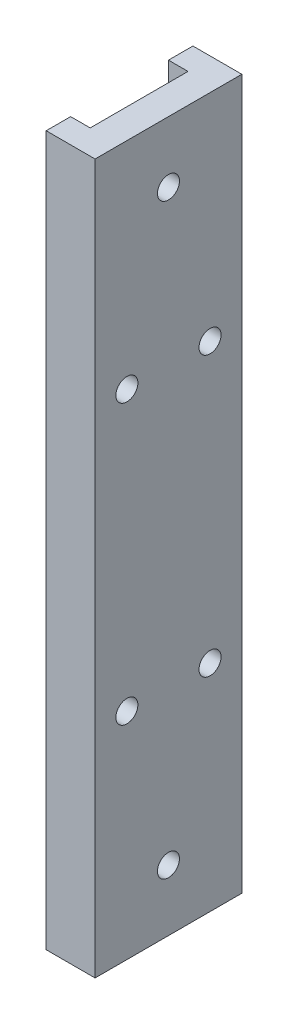
ISO-10303-21;
HEADER;
FILE_DESCRIPTION(('STEP AP214'),'2;1');
FILE_NAME('part.step','',(''),(''),'','','');
FILE_SCHEMA(('AUTOMOTIVE_DESIGN { 1 0 10303 214 1 1 1 1 }'));
ENDSEC;
DATA;
#1=APPLICATION_CONTEXT('core data for automotive mechanical design processes');
#2=APPLICATION_PROTOCOL_DEFINITION('international standard','automotive_design',2000,#1);
#3=PRODUCT_CONTEXT('',#1,'mechanical');
#4=PRODUCT('Part','Part','',(#3));
#5=PRODUCT_RELATED_PRODUCT_CATEGORY('part','',(#4));
#6=PRODUCT_DEFINITION_FORMATION('','',#4);
#7=PRODUCT_DEFINITION_CONTEXT('part definition',#1,'design');
#8=PRODUCT_DEFINITION('design','',#6,#7);
#9=PRODUCT_DEFINITION_SHAPE('','',#8);
#10=(LENGTH_UNIT() NAMED_UNIT(*) SI_UNIT(.MILLI.,.METRE.));
#11=(NAMED_UNIT(*) PLANE_ANGLE_UNIT() SI_UNIT($,.RADIAN.));
#12=(NAMED_UNIT(*) SI_UNIT($,.STERADIAN.) SOLID_ANGLE_UNIT());
#13=UNCERTAINTY_MEASURE_WITH_UNIT(LENGTH_MEASURE(1.E-05),#10,'distance_accuracy_value','');
#14=(GEOMETRIC_REPRESENTATION_CONTEXT(3) GLOBAL_UNCERTAINTY_ASSIGNED_CONTEXT((#13)) GLOBAL_UNIT_ASSIGNED_CONTEXT((#10,
#11,#12)) REPRESENTATION_CONTEXT('',''));
#15=CARTESIAN_POINT('',(0.,0.,0.));
#16=DIRECTION('',(0.,0.,1.));
#17=DIRECTION('',(1.,0.,0.));
#18=AXIS2_PLACEMENT_3D('',#15,#16,#17);
#19=CARTESIAN_POINT('',(-71.5000000000001,115.,122.5));
#20=DIRECTION('',(1.,0.,0.));
#21=DIRECTION('',(0.,0.,-1.));
#22=AXIS2_PLACEMENT_3D('',#19,#20,#21);
#23=PLANE('',#22);
#24=DIRECTION('',(0.,0.,-1.));
#25=VECTOR('',#24,1.);
#26=CARTESIAN_POINT('',(-71.5000000000001,260.,122.5));
#27=LINE('',#26,#25);
#28=CARTESIAN_POINT('',(-71.5,260.,127.5));
#29=VERTEX_POINT('',#28);
#30=CARTESIAN_POINT('',(-71.5000000000001,260.,122.5));
#31=VERTEX_POINT('',#30);
#32=EDGE_CURVE('E185',#29,#31,#27,.T.);
#33=ORIENTED_EDGE('',*,*,#32,.T.);
#34=DIRECTION('',(0.,1.,0.));
#35=VECTOR('',#34,1.);
#36=CARTESIAN_POINT('',(-71.5000000000001,115.,122.5));
#37=LINE('',#36,#35);
#38=CARTESIAN_POINT('',(-71.5000000000001,115.,122.5));
#39=VERTEX_POINT('',#38);
#40=EDGE_CURVE('E11',#39,#31,#37,.T.);
#41=ORIENTED_EDGE('',*,*,#40,.F.);
#42=DIRECTION('',(0.,0.,-1.));
#43=VECTOR('',#42,1.);
#44=CARTESIAN_POINT('',(-71.5000000000001,115.,122.5));
#45=LINE('',#44,#43);
#46=CARTESIAN_POINT('',(-71.5,115.,127.5));
#47=VERTEX_POINT('',#46);
#48=EDGE_CURVE('E203',#47,#39,#45,.T.);
#49=ORIENTED_EDGE('',*,*,#48,.F.);
#50=DIRECTION('',(0.,1.,0.));
#51=VECTOR('',#50,1.);
#52=CARTESIAN_POINT('',(-71.5,115.,127.5));
#53=LINE('',#52,#51);
#54=EDGE_CURVE('E204',#47,#29,#53,.T.);
#55=ORIENTED_EDGE('',*,*,#54,.T.);
#56=EDGE_LOOP('',(#33,#41,#49,#55));
#57=FACE_BOUND('',#56,.T.);
#58=ADVANCED_FACE('F40',(#57),#23,.F.);
#59=CARTESIAN_POINT('',(-67.5000000000001,115.,122.5));
#60=DIRECTION('',(0.,0.,1.));
#61=DIRECTION('',(1.,0.,0.));
#62=AXIS2_PLACEMENT_3D('',#59,#60,#61);
#63=PLANE('',#62);
#64=DIRECTION('',(1.,0.,0.));
#65=VECTOR('',#64,1.);
#66=CARTESIAN_POINT('',(-67.5000000000001,260.,122.5));
#67=LINE('',#66,#65);
#68=CARTESIAN_POINT('',(-67.5000000000001,260.,122.5));
#69=VERTEX_POINT('',#68);
#70=EDGE_CURVE('E178',#31,#69,#67,.T.);
#71=ORIENTED_EDGE('',*,*,#70,.T.);
#72=DIRECTION('',(0.,1.,0.));
#73=VECTOR('',#72,1.);
#74=CARTESIAN_POINT('',(-67.5000000000001,115.,122.5));
#75=LINE('',#74,#73);
#76=CARTESIAN_POINT('',(-67.5000000000001,217.677050983125,122.5));
#77=VERTEX_POINT('',#76);
#78=EDGE_CURVE('E155',#77,#69,#75,.T.);
#79=ORIENTED_EDGE('',*,*,#78,.F.);
#80=CARTESIAN_POINT('',(-67.5000000000001,214.322949016875,122.5));
#81=VERTEX_POINT('',#80);
#82=EDGE_CURVE('E165',#81,#77,#75,.T.);
#83=ORIENTED_EDGE('',*,*,#82,.F.);
#84=CARTESIAN_POINT('',(-67.5000000000001,160.677050983125,122.5));
#85=VERTEX_POINT('',#84);
#86=EDGE_CURVE('E164',#85,#81,#75,.T.);
#87=ORIENTED_EDGE('',*,*,#86,.F.);
#88=CARTESIAN_POINT('',(-67.5000000000001,157.322949016875,122.5));
#89=VERTEX_POINT('',#88);
#90=EDGE_CURVE('E159',#89,#85,#75,.T.);
#91=ORIENTED_EDGE('',*,*,#90,.F.);
#92=CARTESIAN_POINT('',(-67.5000000000001,115.,122.5));
#93=VERTEX_POINT('',#92);
#94=EDGE_CURVE('E48',#93,#89,#75,.T.);
#95=ORIENTED_EDGE('',*,*,#94,.F.);
#96=DIRECTION('',(1.,0.,0.));
#97=VECTOR('',#96,1.);
#98=CARTESIAN_POINT('',(-67.5000000000001,115.,122.5));
#99=LINE('',#98,#97);
#100=EDGE_CURVE('E254',#39,#93,#99,.T.);
#101=ORIENTED_EDGE('',*,*,#100,.F.);
#102=ORIENTED_EDGE('',*,*,#40,.T.);
#103=EDGE_LOOP('',(#71,#79,#83,#87,#91,#95,#101,#102));
#104=FACE_BOUND('',#103,.T.);
#105=ADVANCED_FACE('F177',(#104),#63,.F.);
#106=CARTESIAN_POINT('',(-67.5000000000001,115.,102.5));
#107=DIRECTION('',(1.,0.,0.));
#108=DIRECTION('',(0.,0.,-1.));
#109=AXIS2_PLACEMENT_3D('',#106,#107,#108);
#110=PLANE('',#109);
#111=CARTESIAN_POINT('',(-67.5000000000001,247.5,112.5));
#112=DIRECTION('',(1.,0.,0.));
#113=DIRECTION('',(0.,0.,-1.));
#114=AXIS2_PLACEMENT_3D('',#111,#112,#113);
#115=CIRCLE('',#114,2.25);
#116=CARTESIAN_POINT('',(-67.5000000000001,247.5,110.25));
#117=VERTEX_POINT('',#116);
#118=EDGE_CURVE('E243',#117,#117,#115,.T.);
#119=ORIENTED_EDGE('',*,*,#118,.T.);
#120=EDGE_LOOP('',(#119));
#121=FACE_BOUND('',#120,.T.);
#122=CARTESIAN_POINT('',(-67.5000000000001,127.5,112.5));
#123=DIRECTION('',(1.,0.,0.));
#124=DIRECTION('',(0.,0.,-1.));
#125=AXIS2_PLACEMENT_3D('',#122,#123,#124);
#126=CIRCLE('',#125,2.25);
#127=CARTESIAN_POINT('',(-67.5000000000001,127.5,110.25));
#128=VERTEX_POINT('',#127);
#129=EDGE_CURVE('E43',#128,#128,#126,.T.);
#130=ORIENTED_EDGE('',*,*,#129,.T.);
#131=EDGE_LOOP('',(#130));
#132=FACE_BOUND('',#131,.T.);
#133=DIRECTION('',(0.,1.,0.));
#134=VECTOR('',#133,1.);
#135=CARTESIAN_POINT('',(-67.5000000000001,115.,102.5));
#136=LINE('',#135,#134);
#137=CARTESIAN_POINT('',(-67.5000000000001,217.677050983125,102.5));
#138=VERTEX_POINT('',#137);
#139=CARTESIAN_POINT('',(-67.5000000000001,260.,102.5));
#140=VERTEX_POINT('',#139);
#141=EDGE_CURVE('E136',#138,#140,#136,.T.);
#142=ORIENTED_EDGE('',*,*,#141,.F.);
#143=CARTESIAN_POINT('',(-67.5000000000001,216.,104.));
#144=DIRECTION('',(1.,0.,0.));
#145=DIRECTION('',(0.,0.,-1.));
#146=AXIS2_PLACEMENT_3D('',#143,#144,#145);
#147=CIRCLE('',#146,2.25);
#148=CARTESIAN_POINT('',(-67.5000000000001,214.322949016875,102.5));
#149=VERTEX_POINT('',#148);
#150=EDGE_CURVE('E54',#138,#149,#147,.T.);
#151=ORIENTED_EDGE('',*,*,#150,.T.);
#152=CARTESIAN_POINT('',(-67.5000000000001,160.677050983125,102.5));
#153=VERTEX_POINT('',#152);
#154=EDGE_CURVE('E135',#153,#149,#136,.T.);
#155=ORIENTED_EDGE('',*,*,#154,.F.);
#156=CARTESIAN_POINT('',(-67.5000000000001,159.,104.));
#157=DIRECTION('',(1.,0.,0.));
#158=DIRECTION('',(0.,0.,-1.));
#159=AXIS2_PLACEMENT_3D('',#156,#157,#158);
#160=CIRCLE('',#159,2.25);
#161=CARTESIAN_POINT('',(-67.5000000000001,157.322949016875,102.5));
#162=VERTEX_POINT('',#161);
#163=EDGE_CURVE('E257',#153,#162,#160,.T.);
#164=ORIENTED_EDGE('',*,*,#163,.T.);
#165=CARTESIAN_POINT('',(-67.5000000000001,115.,102.5));
#166=VERTEX_POINT('',#165);
#167=EDGE_CURVE('E152',#166,#162,#136,.T.);
#168=ORIENTED_EDGE('',*,*,#167,.F.);
#169=DIRECTION('',(0.,0.,-1.));
#170=VECTOR('',#169,1.);
#171=CARTESIAN_POINT('',(-67.5000000000001,115.,102.5));
#172=LINE('',#171,#170);
#173=EDGE_CURVE('E232',#93,#166,#172,.T.);
#174=ORIENTED_EDGE('',*,*,#173,.F.);
#175=ORIENTED_EDGE('',*,*,#94,.T.);
#176=CARTESIAN_POINT('',(-67.5000000000001,159.,121.));
#177=DIRECTION('',(1.,0.,0.));
#178=DIRECTION('',(0.,0.,-1.));
#179=AXIS2_PLACEMENT_3D('',#176,#177,#178);
#180=CIRCLE('',#179,2.25);
#181=EDGE_CURVE('E174',#89,#85,#180,.T.);
#182=ORIENTED_EDGE('',*,*,#181,.T.);
#183=ORIENTED_EDGE('',*,*,#86,.T.);
#184=CARTESIAN_POINT('',(-67.5000000000001,216.,121.));
#185=DIRECTION('',(1.,0.,0.));
#186=DIRECTION('',(0.,0.,-1.));
#187=AXIS2_PLACEMENT_3D('',#184,#185,#186);
#188=CIRCLE('',#187,2.25);
#189=EDGE_CURVE('E173',#81,#77,#188,.T.);
#190=ORIENTED_EDGE('',*,*,#189,.T.);
#191=ORIENTED_EDGE('',*,*,#78,.T.);
#192=DIRECTION('',(0.,0.,-1.));
#193=VECTOR('',#192,1.);
#194=CARTESIAN_POINT('',(-67.5000000000001,260.,102.5));
#195=LINE('',#194,#193);
#196=EDGE_CURVE('E184',#69,#140,#195,.T.);
#197=ORIENTED_EDGE('',*,*,#196,.T.);
#198=EDGE_LOOP('',(#142,#151,#155,#164,#168,#174,#175,#182,#183,#190,#191,#197));
#199=FACE_BOUND('',#198,.T.);
#200=ADVANCED_FACE('F144',(#121,#132,#199),#110,.F.);
#201=CARTESIAN_POINT('',(-71.5000000000001,115.,102.5));
#202=DIRECTION('',(0.,0.,-1.));
#203=DIRECTION('',(-1.,0.,0.));
#204=AXIS2_PLACEMENT_3D('',#201,#202,#203);
#205=PLANE('',#204);
#206=DIRECTION('',(-1.,0.,0.));
#207=VECTOR('',#206,1.);
#208=CARTESIAN_POINT('',(-71.5000000000001,260.,102.5));
#209=LINE('',#208,#207);
#210=CARTESIAN_POINT('',(-71.5000000000001,260.,102.5));
#211=VERTEX_POINT('',#210);
#212=EDGE_CURVE('E190',#140,#211,#209,.T.);
#213=ORIENTED_EDGE('',*,*,#212,.T.);
#214=DIRECTION('',(0.,1.,0.));
#215=VECTOR('',#214,1.);
#216=CARTESIAN_POINT('',(-71.5000000000001,115.,102.5));
#217=LINE('',#216,#215);
#218=CARTESIAN_POINT('',(-71.5000000000001,115.,102.5));
#219=VERTEX_POINT('',#218);
#220=EDGE_CURVE('E156',#219,#211,#217,.T.);
#221=ORIENTED_EDGE('',*,*,#220,.F.);
#222=DIRECTION('',(-1.,0.,0.));
#223=VECTOR('',#222,1.);
#224=CARTESIAN_POINT('',(-71.5000000000001,115.,102.5));
#225=LINE('',#224,#223);
#226=EDGE_CURVE('E224',#166,#219,#225,.T.);
#227=ORIENTED_EDGE('',*,*,#226,.F.);
#228=ORIENTED_EDGE('',*,*,#167,.T.);
#229=EDGE_CURVE('E151',#162,#153,#136,.T.);
#230=ORIENTED_EDGE('',*,*,#229,.T.);
#231=ORIENTED_EDGE('',*,*,#154,.T.);
#232=EDGE_CURVE('E129',#149,#138,#136,.T.);
#233=ORIENTED_EDGE('',*,*,#232,.T.);
#234=ORIENTED_EDGE('',*,*,#141,.T.);
#235=EDGE_LOOP('',(#213,#221,#227,#228,#230,#231,#233,#234));
#236=FACE_BOUND('',#235,.T.);
#237=ADVANCED_FACE('F149',(#236),#205,.F.);
#238=CARTESIAN_POINT('',(-71.5000000000001,115.,97.5));
#239=DIRECTION('',(1.,0.,0.));
#240=DIRECTION('',(0.,0.,-1.));
#241=AXIS2_PLACEMENT_3D('',#238,#239,#240);
#242=PLANE('',#241);
#243=DIRECTION('',(0.,0.,-1.));
#244=VECTOR('',#243,1.);
#245=CARTESIAN_POINT('',(-71.5000000000001,260.,97.5));
#246=LINE('',#245,#244);
#247=CARTESIAN_POINT('',(-71.5000000000001,260.,97.5));
#248=VERTEX_POINT('',#247);
#249=EDGE_CURVE('E192',#211,#248,#246,.T.);
#250=ORIENTED_EDGE('',*,*,#249,.T.);
#251=DIRECTION('',(0.,1.,0.));
#252=VECTOR('',#251,1.);
#253=CARTESIAN_POINT('',(-71.5000000000001,115.,97.5));
#254=LINE('',#253,#252);
#255=CARTESIAN_POINT('',(-71.5000000000001,115.,97.5));
#256=VERTEX_POINT('',#255);
#257=EDGE_CURVE('E213',#256,#248,#254,.T.);
#258=ORIENTED_EDGE('',*,*,#257,.F.);
#259=DIRECTION('',(0.,0.,-1.));
#260=VECTOR('',#259,1.);
#261=CARTESIAN_POINT('',(-71.5000000000001,115.,97.5));
#262=LINE('',#261,#260);
#263=EDGE_CURVE('E225',#219,#256,#262,.T.);
#264=ORIENTED_EDGE('',*,*,#263,.F.);
#265=ORIENTED_EDGE('',*,*,#220,.T.);
#266=EDGE_LOOP('',(#250,#258,#264,#265));
#267=FACE_BOUND('',#266,.T.);
#268=ADVANCED_FACE('F226',(#267),#242,.F.);
#269=CARTESIAN_POINT('',(-61.5000000000001,115.,97.5));
#270=DIRECTION('',(0.,0.,1.));
#271=DIRECTION('',(1.,0.,0.));
#272=AXIS2_PLACEMENT_3D('',#269,#270,#271);
#273=PLANE('',#272);
#274=DIRECTION('',(1.,0.,0.));
#275=VECTOR('',#274,1.);
#276=CARTESIAN_POINT('',(-61.5000000000001,260.,97.5));
#277=LINE('',#276,#275);
#278=CARTESIAN_POINT('',(-61.5000000000001,260.,97.5));
#279=VERTEX_POINT('',#278);
#280=EDGE_CURVE('E197',#248,#279,#277,.T.);
#281=ORIENTED_EDGE('',*,*,#280,.T.);
#282=DIRECTION('',(0.,1.,0.));
#283=VECTOR('',#282,1.);
#284=CARTESIAN_POINT('',(-61.5000000000001,115.,97.5));
#285=LINE('',#284,#283);
#286=CARTESIAN_POINT('',(-61.5000000000001,115.,97.5));
#287=VERTEX_POINT('',#286);
#288=EDGE_CURVE('E211',#287,#279,#285,.T.);
#289=ORIENTED_EDGE('',*,*,#288,.F.);
#290=DIRECTION('',(1.,0.,0.));
#291=VECTOR('',#290,1.);
#292=CARTESIAN_POINT('',(-61.5000000000001,115.,97.5));
#293=LINE('',#292,#291);
#294=EDGE_CURVE('E228',#256,#287,#293,.T.);
#295=ORIENTED_EDGE('',*,*,#294,.F.);
#296=ORIENTED_EDGE('',*,*,#257,.T.);
#297=EDGE_LOOP('',(#281,#289,#295,#296));
#298=FACE_BOUND('',#297,.T.);
#299=ADVANCED_FACE('F282',(#298),#273,.F.);
#300=CARTESIAN_POINT('',(-61.5000000000001,115.,127.5));
#301=DIRECTION('',(-1.,0.,0.));
#302=DIRECTION('',(0.,0.,1.));
#303=AXIS2_PLACEMENT_3D('',#300,#301,#302);
#304=PLANE('',#303);
#305=CARTESIAN_POINT('',(-61.5000000000001,216.,104.));
#306=DIRECTION('',(1.,0.,0.));
#307=DIRECTION('',(0.,0.,-1.));
#308=AXIS2_PLACEMENT_3D('',#305,#306,#307);
#309=CIRCLE('',#308,2.25);
#310=CARTESIAN_POINT('',(-61.5000000000001,216.,101.75));
#311=VERTEX_POINT('',#310);
#312=EDGE_CURVE('E140',#311,#311,#309,.T.);
#313=ORIENTED_EDGE('',*,*,#312,.F.);
#314=EDGE_LOOP('',(#313));
#315=FACE_BOUND('',#314,.T.);
#316=CARTESIAN_POINT('',(-61.5000000000001,216.,121.));
#317=DIRECTION('',(1.,0.,0.));
#318=DIRECTION('',(0.,0.,-1.));
#319=AXIS2_PLACEMENT_3D('',#316,#317,#318);
#320=CIRCLE('',#319,2.25);
#321=CARTESIAN_POINT('',(-61.5000000000001,216.,118.75));
#322=VERTEX_POINT('',#321);
#323=EDGE_CURVE('E148',#322,#322,#320,.T.);
#324=ORIENTED_EDGE('',*,*,#323,.F.);
#325=EDGE_LOOP('',(#324));
#326=FACE_BOUND('',#325,.T.);
#327=CARTESIAN_POINT('',(-61.5000000000001,159.,104.));
#328=DIRECTION('',(1.,0.,0.));
#329=DIRECTION('',(0.,0.,-1.));
#330=AXIS2_PLACEMENT_3D('',#327,#328,#329);
#331=CIRCLE('',#330,2.25);
#332=CARTESIAN_POINT('',(-61.5000000000001,159.,101.75));
#333=VERTEX_POINT('',#332);
#334=EDGE_CURVE('E266',#333,#333,#331,.T.);
#335=ORIENTED_EDGE('',*,*,#334,.F.);
#336=EDGE_LOOP('',(#335));
#337=FACE_BOUND('',#336,.T.);
#338=CARTESIAN_POINT('',(-61.5000000000001,159.,121.));
#339=DIRECTION('',(1.,0.,0.));
#340=DIRECTION('',(0.,0.,-1.));
#341=AXIS2_PLACEMENT_3D('',#338,#339,#340);
#342=CIRCLE('',#341,2.25);
#343=CARTESIAN_POINT('',(-61.5000000000001,159.,118.75));
#344=VERTEX_POINT('',#343);
#345=EDGE_CURVE('E261',#344,#344,#342,.T.);
#346=ORIENTED_EDGE('',*,*,#345,.F.);
#347=EDGE_LOOP('',(#346));
#348=FACE_BOUND('',#347,.T.);
#349=CARTESIAN_POINT('',(-61.5000000000001,247.5,112.5));
#350=DIRECTION('',(1.,0.,0.));
#351=DIRECTION('',(0.,0.,-1.));
#352=AXIS2_PLACEMENT_3D('',#349,#350,#351);
#353=CIRCLE('',#352,2.25);
#354=CARTESIAN_POINT('',(-61.5000000000001,247.5,110.25));
#355=VERTEX_POINT('',#354);
#356=EDGE_CURVE('E248',#355,#355,#353,.T.);
#357=ORIENTED_EDGE('',*,*,#356,.F.);
#358=EDGE_LOOP('',(#357));
#359=FACE_BOUND('',#358,.T.);
#360=CARTESIAN_POINT('',(-61.5000000000001,127.5,112.5));
#361=DIRECTION('',(1.,0.,0.));
#362=DIRECTION('',(0.,0.,-1.));
#363=AXIS2_PLACEMENT_3D('',#360,#361,#362);
#364=CIRCLE('',#363,2.25);
#365=CARTESIAN_POINT('',(-61.5000000000001,127.5,110.25));
#366=VERTEX_POINT('',#365);
#367=EDGE_CURVE('E239',#366,#366,#364,.T.);
#368=ORIENTED_EDGE('',*,*,#367,.F.);
#369=EDGE_LOOP('',(#368));
#370=FACE_BOUND('',#369,.T.);
#371=DIRECTION('',(0.,0.,1.));
#372=VECTOR('',#371,1.);
#373=CARTESIAN_POINT('',(-61.5000000000001,260.,127.5));
#374=LINE('',#373,#372);
#375=CARTESIAN_POINT('',(-61.5000000000001,260.,127.5));
#376=VERTEX_POINT('',#375);
#377=EDGE_CURVE('E199',#279,#376,#374,.T.);
#378=ORIENTED_EDGE('',*,*,#377,.T.);
#379=DIRECTION('',(0.,1.,0.));
#380=VECTOR('',#379,1.);
#381=CARTESIAN_POINT('',(-61.5000000000001,115.,127.5));
#382=LINE('',#381,#380);
#383=CARTESIAN_POINT('',(-61.5000000000001,115.,127.5));
#384=VERTEX_POINT('',#383);
#385=EDGE_CURVE('E207',#384,#376,#382,.T.);
#386=ORIENTED_EDGE('',*,*,#385,.F.);
#387=DIRECTION('',(0.,0.,1.));
#388=VECTOR('',#387,1.);
#389=CARTESIAN_POINT('',(-61.5000000000001,115.,127.5));
#390=LINE('',#389,#388);
#391=EDGE_CURVE('E230',#287,#384,#390,.T.);
#392=ORIENTED_EDGE('',*,*,#391,.F.);
#393=ORIENTED_EDGE('',*,*,#288,.T.);
#394=EDGE_LOOP('',(#378,#386,#392,#393));
#395=FACE_BOUND('',#394,.T.);
#396=ADVANCED_FACE('F278',(#315,#326,#337,#348,#359,#370,#395),#304,.F.);
#397=CARTESIAN_POINT('',(-71.5,115.,127.5));
#398=DIRECTION('',(0.,0.,-1.));
#399=DIRECTION('',(-1.,0.,0.));
#400=AXIS2_PLACEMENT_3D('',#397,#398,#399);
#401=PLANE('',#400);
#402=DIRECTION('',(-1.,0.,0.));
#403=VECTOR('',#402,1.);
#404=CARTESIAN_POINT('',(-71.5,260.,127.5));
#405=LINE('',#404,#403);
#406=EDGE_CURVE('E201',#376,#29,#405,.T.);
#407=ORIENTED_EDGE('',*,*,#406,.T.);
#408=ORIENTED_EDGE('',*,*,#54,.F.);
#409=DIRECTION('',(-1.,0.,0.));
#410=VECTOR('',#409,1.);
#411=CARTESIAN_POINT('',(-71.5,115.,127.5));
#412=LINE('',#411,#410);
#413=EDGE_CURVE('E208',#384,#47,#412,.T.);
#414=ORIENTED_EDGE('',*,*,#413,.F.);
#415=ORIENTED_EDGE('',*,*,#385,.T.);
#416=EDGE_LOOP('',(#407,#408,#414,#415));
#417=FACE_BOUND('',#416,.T.);
#418=ADVANCED_FACE('F281',(#417),#401,.F.);
#419=CARTESIAN_POINT('',(0.,115.,0.));
#420=DIRECTION('',(0.,1.,0.));
#421=DIRECTION('',(0.,0.,1.));
#422=AXIS2_PLACEMENT_3D('',#419,#420,#421);
#423=PLANE('',#422);
#424=ORIENTED_EDGE('',*,*,#48,.T.);
#425=ORIENTED_EDGE('',*,*,#100,.T.);
#426=ORIENTED_EDGE('',*,*,#173,.T.);
#427=ORIENTED_EDGE('',*,*,#226,.T.);
#428=ORIENTED_EDGE('',*,*,#263,.T.);
#429=ORIENTED_EDGE('',*,*,#294,.T.);
#430=ORIENTED_EDGE('',*,*,#391,.T.);
#431=ORIENTED_EDGE('',*,*,#413,.T.);
#432=EDGE_LOOP('',(#424,#425,#426,#427,#428,#429,#430,#431));
#433=FACE_BOUND('',#432,.T.);
#434=ADVANCED_FACE('F256',(#433),#423,.F.);
#435=CARTESIAN_POINT('',(0.,260.,0.));
#436=DIRECTION('',(0.,1.,0.));
#437=DIRECTION('',(0.,0.,1.));
#438=AXIS2_PLACEMENT_3D('',#435,#436,#437);
#439=PLANE('',#438);
#440=ORIENTED_EDGE('',*,*,#32,.F.);
#441=ORIENTED_EDGE('',*,*,#406,.F.);
#442=ORIENTED_EDGE('',*,*,#377,.F.);
#443=ORIENTED_EDGE('',*,*,#280,.F.);
#444=ORIENTED_EDGE('',*,*,#249,.F.);
#445=ORIENTED_EDGE('',*,*,#212,.F.);
#446=ORIENTED_EDGE('',*,*,#196,.F.);
#447=ORIENTED_EDGE('',*,*,#70,.F.);
#448=EDGE_LOOP('',(#440,#441,#442,#443,#444,#445,#446,#447));
#449=FACE_BOUND('',#448,.T.);
#450=ADVANCED_FACE('F188',(#449),#439,.T.);
#451=CARTESIAN_POINT('',(-61.5000000000001,127.5,112.5));
#452=DIRECTION('',(1.,0.,0.));
#453=DIRECTION('',(0.,0.,-1.));
#454=AXIS2_PLACEMENT_3D('',#451,#452,#453);
#455=CYLINDRICAL_SURFACE('',#454,2.25);
#456=ORIENTED_EDGE('',*,*,#367,.T.);
#457=EDGE_LOOP('',(#456));
#458=FACE_BOUND('',#457,.T.);
#459=ORIENTED_EDGE('',*,*,#129,.F.);
#460=EDGE_LOOP('',(#459));
#461=FACE_BOUND('',#460,.T.);
#462=ADVANCED_FACE('F418',(#458,#461),#455,.F.);
#463=CARTESIAN_POINT('',(-61.5000000000001,247.5,112.5));
#464=DIRECTION('',(1.,0.,0.));
#465=DIRECTION('',(0.,0.,-1.));
#466=AXIS2_PLACEMENT_3D('',#463,#464,#465);
#467=CYLINDRICAL_SURFACE('',#466,2.25);
#468=ORIENTED_EDGE('',*,*,#356,.T.);
#469=EDGE_LOOP('',(#468));
#470=FACE_BOUND('',#469,.T.);
#471=ORIENTED_EDGE('',*,*,#118,.F.);
#472=EDGE_LOOP('',(#471));
#473=FACE_BOUND('',#472,.T.);
#474=ADVANCED_FACE('F275',(#470,#473),#467,.F.);
#475=CARTESIAN_POINT('',(-67.5000000000001,159.,121.));
#476=DIRECTION('',(-1.,0.,0.));
#477=DIRECTION('',(0.,0.,1.));
#478=AXIS2_PLACEMENT_3D('',#475,#476,#477);
#479=PLANE('',#478);
#480=ORIENTED_EDGE('',*,*,#90,.T.);
#481=EDGE_CURVE('E270',#85,#89,#180,.T.);
#482=ORIENTED_EDGE('',*,*,#481,.T.);
#483=EDGE_LOOP('',(#480,#482));
#484=FACE_BOUND('',#483,.T.);
#485=ADVANCED_FACE('F325',(#484),#479,.F.);
#486=CARTESIAN_POINT('',(-61.5000000000001,159.,121.));
#487=DIRECTION('',(1.,0.,0.));
#488=DIRECTION('',(0.,0.,-1.));
#489=AXIS2_PLACEMENT_3D('',#486,#487,#488);
#490=CYLINDRICAL_SURFACE('',#489,2.25);
#491=ORIENTED_EDGE('',*,*,#481,.F.);
#492=ORIENTED_EDGE('',*,*,#181,.F.);
#493=EDGE_LOOP('',(#491,#492));
#494=FACE_BOUND('',#493,.T.);
#495=ORIENTED_EDGE('',*,*,#345,.T.);
#496=EDGE_LOOP('',(#495));
#497=FACE_BOUND('',#496,.T.);
#498=ADVANCED_FACE('F330',(#494,#497),#490,.F.);
#499=CARTESIAN_POINT('',(-67.5000000000001,159.,104.));
#500=DIRECTION('',(-1.,0.,0.));
#501=DIRECTION('',(0.,0.,1.));
#502=AXIS2_PLACEMENT_3D('',#499,#500,#501);
#503=PLANE('',#502);
#504=EDGE_CURVE('E262',#162,#153,#160,.T.);
#505=ORIENTED_EDGE('',*,*,#504,.T.);
#506=ORIENTED_EDGE('',*,*,#229,.F.);
#507=EDGE_LOOP('',(#505,#506));
#508=FACE_BOUND('',#507,.T.);
#509=ADVANCED_FACE('F343',(#508),#503,.F.);
#510=CARTESIAN_POINT('',(-61.5000000000001,159.,104.));
#511=DIRECTION('',(1.,0.,0.));
#512=DIRECTION('',(0.,0.,-1.));
#513=AXIS2_PLACEMENT_3D('',#510,#511,#512);
#514=CYLINDRICAL_SURFACE('',#513,2.25);
#515=ORIENTED_EDGE('',*,*,#163,.F.);
#516=ORIENTED_EDGE('',*,*,#504,.F.);
#517=EDGE_LOOP('',(#515,#516));
#518=FACE_BOUND('',#517,.T.);
#519=ORIENTED_EDGE('',*,*,#334,.T.);
#520=EDGE_LOOP('',(#519));
#521=FACE_BOUND('',#520,.T.);
#522=ADVANCED_FACE('F354',(#518,#521),#514,.F.);
#523=CARTESIAN_POINT('',(-67.5000000000001,216.,121.));
#524=DIRECTION('',(-1.,0.,0.));
#525=DIRECTION('',(0.,0.,1.));
#526=AXIS2_PLACEMENT_3D('',#523,#524,#525);
#527=PLANE('',#526);
#528=ORIENTED_EDGE('',*,*,#82,.T.);
#529=EDGE_CURVE('E61',#77,#81,#188,.T.);
#530=ORIENTED_EDGE('',*,*,#529,.T.);
#531=EDGE_LOOP('',(#528,#530));
#532=FACE_BOUND('',#531,.T.);
#533=ADVANCED_FACE('F365',(#532),#527,.F.);
#534=CARTESIAN_POINT('',(-61.5000000000001,216.,121.));
#535=DIRECTION('',(1.,0.,0.));
#536=DIRECTION('',(0.,0.,-1.));
#537=AXIS2_PLACEMENT_3D('',#534,#535,#536);
#538=CYLINDRICAL_SURFACE('',#537,2.25);
#539=ORIENTED_EDGE('',*,*,#529,.F.);
#540=ORIENTED_EDGE('',*,*,#189,.F.);
#541=EDGE_LOOP('',(#539,#540));
#542=FACE_BOUND('',#541,.T.);
#543=ORIENTED_EDGE('',*,*,#323,.T.);
#544=EDGE_LOOP('',(#543));
#545=FACE_BOUND('',#544,.T.);
#546=ADVANCED_FACE('F375',(#542,#545),#538,.F.);
#547=CARTESIAN_POINT('',(-67.5000000000001,216.,104.));
#548=DIRECTION('',(-1.,0.,0.));
#549=DIRECTION('',(0.,0.,1.));
#550=AXIS2_PLACEMENT_3D('',#547,#548,#549);
#551=PLANE('',#550);
#552=EDGE_CURVE('E131',#149,#138,#147,.T.);
#553=ORIENTED_EDGE('',*,*,#552,.T.);
#554=ORIENTED_EDGE('',*,*,#232,.F.);
#555=EDGE_LOOP('',(#553,#554));
#556=FACE_BOUND('',#555,.T.);
#557=ADVANCED_FACE('F130',(#556),#551,.F.);
#558=CARTESIAN_POINT('',(-61.5000000000001,216.,104.));
#559=DIRECTION('',(1.,0.,0.));
#560=DIRECTION('',(0.,0.,-1.));
#561=AXIS2_PLACEMENT_3D('',#558,#559,#560);
#562=CYLINDRICAL_SURFACE('',#561,2.25);
#563=ORIENTED_EDGE('',*,*,#150,.F.);
#564=ORIENTED_EDGE('',*,*,#552,.F.);
#565=EDGE_LOOP('',(#563,#564));
#566=FACE_BOUND('',#565,.T.);
#567=ORIENTED_EDGE('',*,*,#312,.T.);
#568=EDGE_LOOP('',(#567));
#569=FACE_BOUND('',#568,.T.);
#570=ADVANCED_FACE('F138',(#566,#569),#562,.F.);
#571=CLOSED_SHELL('',(#58,#105,#200,#237,#268,#299,#396,#418,#434,#450,#462,#474,#485,#498,#509,
#522,#533,#546,#557,#570));
#572=MANIFOLD_SOLID_BREP('B2',#571);
#573=ADVANCED_BREP_SHAPE_REPRESENTATION('',(#18,#572),#14);
#574=SHAPE_DEFINITION_REPRESENTATION(#9,#573);
ENDSEC;
END-ISO-10303-21;
